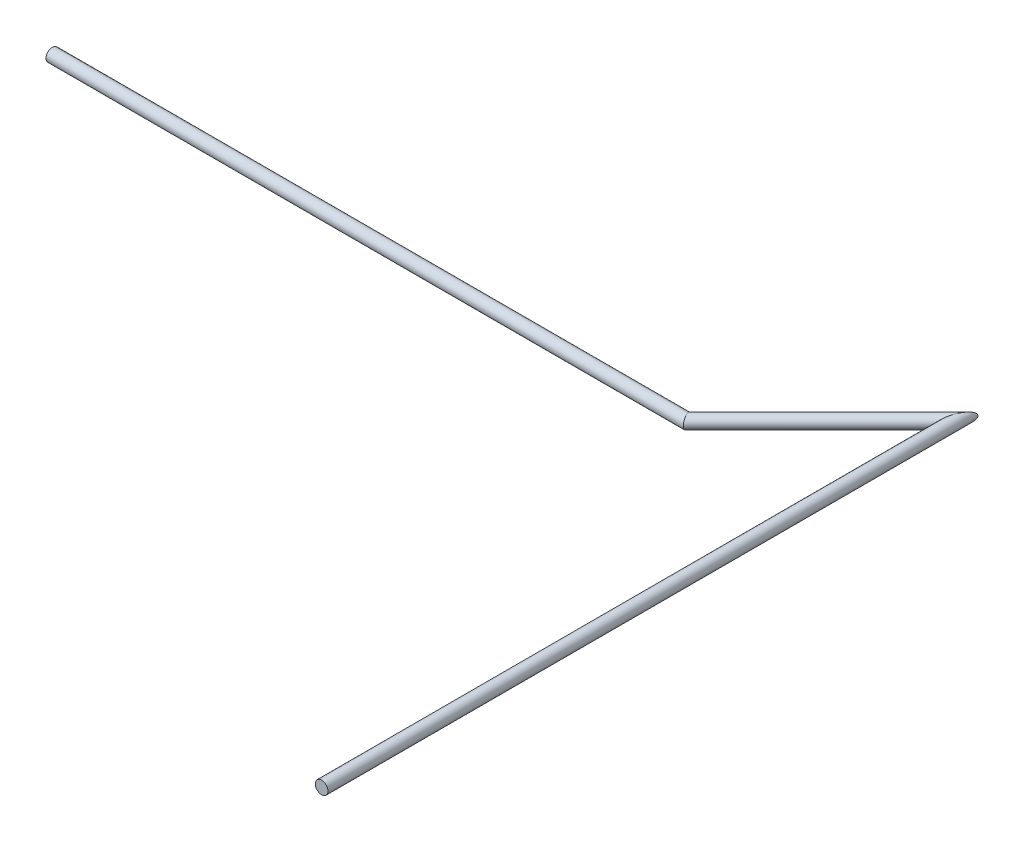
ISO-10303-21;
HEADER;
FILE_DESCRIPTION(('STEP AP214'),'2;1');
FILE_NAME('part.step','',(''),(''),'','','');
FILE_SCHEMA(('AUTOMOTIVE_DESIGN { 1 0 10303 214 1 1 1 1 }'));
ENDSEC;
DATA;
#1=APPLICATION_CONTEXT('core data for automotive mechanical design processes');
#2=APPLICATION_PROTOCOL_DEFINITION('international standard','automotive_design',2000,#1);
#3=PRODUCT_CONTEXT('',#1,'mechanical');
#4=PRODUCT('Part','Part','',(#3));
#5=PRODUCT_RELATED_PRODUCT_CATEGORY('part','',(#4));
#6=PRODUCT_DEFINITION_FORMATION('','',#4);
#7=PRODUCT_DEFINITION_CONTEXT('part definition',#1,'design');
#8=PRODUCT_DEFINITION('design','',#6,#7);
#9=PRODUCT_DEFINITION_SHAPE('','',#8);
#10=(LENGTH_UNIT() NAMED_UNIT(*) SI_UNIT(.MILLI.,.METRE.));
#11=(NAMED_UNIT(*) PLANE_ANGLE_UNIT() SI_UNIT($,.RADIAN.));
#12=(NAMED_UNIT(*) SI_UNIT($,.STERADIAN.) SOLID_ANGLE_UNIT());
#13=UNCERTAINTY_MEASURE_WITH_UNIT(LENGTH_MEASURE(1.E-05),#10,'distance_accuracy_value','');
#14=(GEOMETRIC_REPRESENTATION_CONTEXT(3) GLOBAL_UNCERTAINTY_ASSIGNED_CONTEXT((#13)) GLOBAL_UNIT_ASSIGNED_CONTEXT((#10,
#11,#12)) REPRESENTATION_CONTEXT('',''));
#15=CARTESIAN_POINT('',(0.,0.,0.));
#16=DIRECTION('',(0.,0.,1.));
#17=DIRECTION('',(1.,0.,0.));
#18=AXIS2_PLACEMENT_3D('',#15,#16,#17);
#19=CARTESIAN_POINT('',(-106.066017177982,0.,106.066017177982));
#20=DIRECTION('',(-1.,0.,0.));
#21=DIRECTION('',(0.,-1.,0.));
#22=AXIS2_PLACEMENT_3D('',#19,#20,#21);
#23=CYLINDRICAL_SURFACE('',#22,5.);
#24=CARTESIAN_POINT('',(-606.066017177982,0.,106.066017177982));
#25=DIRECTION('',(1.,0.,0.));
#26=DIRECTION('',(0.,0.,-1.));
#27=AXIS2_PLACEMENT_3D('',#24,#25,#26);
#28=CIRCLE('',#27,5.);
#29=CARTESIAN_POINT('',(-606.066017177982,0.,101.066017177982));
#30=VERTEX_POINT('',#29);
#31=EDGE_CURVE('E56',#30,#30,#28,.T.);
#32=ORIENTED_EDGE('',*,*,#31,.T.);
#33=EDGE_LOOP('',(#32));
#34=FACE_BOUND('',#33,.T.);
#35=CARTESIAN_POINT('',(-106.066017177982,0.,106.066017177982));
#36=DIRECTION('',(0.923879532511287,0.,-0.38268343236509));
#37=DIRECTION('',(-0.38268343236509,0.,-0.923879532511287));
#38=AXIS2_PLACEMENT_3D('',#35,#36,#37);
#39=ELLIPSE('',#38,5.41196100146197,5.);
#40=CARTESIAN_POINT('',(-108.137084989847,0.,101.066017177982));
#41=VERTEX_POINT('',#40);
#42=EDGE_CURVE('E12',#41,#41,#39,.T.);
#43=ORIENTED_EDGE('',*,*,#42,.F.);
#44=EDGE_LOOP('',(#43));
#45=FACE_BOUND('',#44,.T.);
#46=ADVANCED_FACE('F49',(#34,#45),#23,.T.);
#47=CARTESIAN_POINT('',(-606.066017177982,0.,106.066017177982));
#48=DIRECTION('',(1.,0.,0.));
#49=DIRECTION('',(0.,0.,-1.));
#50=AXIS2_PLACEMENT_3D('',#47,#48,#49);
#51=PLANE('',#50);
#52=ORIENTED_EDGE('',*,*,#31,.F.);
#53=EDGE_LOOP('',(#52));
#54=FACE_BOUND('',#53,.T.);
#55=ADVANCED_FACE('F64',(#54),#51,.F.);
#56=CARTESIAN_POINT('',(-106.066017177982,0.,106.066017177982));
#57=DIRECTION('',(0.923879532511287,0.,-0.38268343236509));
#58=DIRECTION('',(-0.38268343236509,0.,-0.923879532511287));
#59=AXIS2_PLACEMENT_3D('',#56,#57,#58);
#60=PLANE('',#59);
#61=ORIENTED_EDGE('',*,*,#42,.T.);
#62=EDGE_LOOP('',(#61));
#63=FACE_BOUND('',#62,.T.);
#64=ADVANCED_FACE('F51',(#63),#60,.T.);
#65=CLOSED_SHELL('',(#46,#55,#64));
#66=MANIFOLD_SOLID_BREP('B2',#65);
#67=CARTESIAN_POINT('',(0.,0.,0.));
#68=DIRECTION('',(-0.707106781186546,0.,0.707106781186549));
#69=DIRECTION('',(0.707106781186549,0.,0.707106781186546));
#70=AXIS2_PLACEMENT_3D('',#67,#68,#69);
#71=CYLINDRICAL_SURFACE('',#70,5.);
#72=CARTESIAN_POINT('',(0.,0.,0.));
#73=DIRECTION('',(0.923879532511287,0.,0.382683432365089));
#74=DIRECTION('',(-0.382683432365089,0.,0.923879532511287));
#75=AXIS2_PLACEMENT_3D('',#72,#73,#74);
#76=ELLIPSE('',#75,13.0656296487638,5.);
#77=CARTESIAN_POINT('',(-4.99999999999997,0.,12.0710678118654));
#78=VERTEX_POINT('',#77);
#79=EDGE_CURVE('E124',#78,#78,#76,.T.);
#80=ORIENTED_EDGE('',*,*,#79,.F.);
#81=EDGE_LOOP('',(#80));
#82=FACE_BOUND('',#81,.T.);
#83=CARTESIAN_POINT('',(-106.066017177982,0.,106.066017177982));
#84=DIRECTION('',(-0.923879532511287,0.,0.38268343236509));
#85=DIRECTION('',(0.38268343236509,0.,0.923879532511287));
#86=AXIS2_PLACEMENT_3D('',#83,#84,#85);
#87=ELLIPSE('',#86,5.41196100146197,5.);
#88=CARTESIAN_POINT('',(-103.994949366116,0.,111.066017177982));
#89=VERTEX_POINT('',#88);
#90=EDGE_CURVE('E48',#89,#89,#87,.T.);
#91=ORIENTED_EDGE('',*,*,#90,.F.);
#92=EDGE_LOOP('',(#91));
#93=FACE_BOUND('',#92,.T.);
#94=ADVANCED_FACE('F117',(#82,#93),#71,.T.);
#95=CARTESIAN_POINT('',(0.,0.,0.));
#96=DIRECTION('',(0.923879532511287,0.,0.382683432365089));
#97=DIRECTION('',(0.382683432365089,0.,-0.923879532511287));
#98=AXIS2_PLACEMENT_3D('',#95,#96,#97);
#99=PLANE('',#98);
#100=ORIENTED_EDGE('',*,*,#79,.T.);
#101=EDGE_LOOP('',(#100));
#102=FACE_BOUND('',#101,.T.);
#103=ADVANCED_FACE('F130',(#102),#99,.T.);
#104=CARTESIAN_POINT('',(-106.066017177982,0.,106.066017177982));
#105=DIRECTION('',(-0.923879532511287,0.,0.38268343236509));
#106=DIRECTION('',(0.38268343236509,0.,0.923879532511287));
#107=AXIS2_PLACEMENT_3D('',#104,#105,#106);
#108=PLANE('',#107);
#109=ORIENTED_EDGE('',*,*,#90,.T.);
#110=EDGE_LOOP('',(#109));
#111=FACE_BOUND('',#110,.T.);
#112=ADVANCED_FACE('F119',(#111),#108,.T.);
#113=CLOSED_SHELL('',(#94,#103,#112));
#114=MANIFOLD_SOLID_BREP('B7',#113);
#115=CARTESIAN_POINT('',(0.,0.,500.));
#116=DIRECTION('',(0.,0.,-1.));
#117=DIRECTION('',(-1.,0.,0.));
#118=AXIS2_PLACEMENT_3D('',#115,#116,#117);
#119=CYLINDRICAL_SURFACE('',#118,5.);
#120=CARTESIAN_POINT('',(0.,0.,500.));
#121=DIRECTION('',(0.,0.,1.));
#122=DIRECTION('',(1.,0.,0.));
#123=AXIS2_PLACEMENT_3D('',#120,#121,#122);
#124=CIRCLE('',#123,5.);
#125=CARTESIAN_POINT('',(5.,0.,500.));
#126=VERTEX_POINT('',#125);
#127=EDGE_CURVE('E187',#126,#126,#124,.T.);
#128=ORIENTED_EDGE('',*,*,#127,.F.);
#129=EDGE_LOOP('',(#128));
#130=FACE_BOUND('',#129,.T.);
#131=CARTESIAN_POINT('',(0.,0.,0.));
#132=DIRECTION('',(-0.923879532511287,0.,-0.382683432365089));
#133=DIRECTION('',(0.382683432365089,0.,-0.923879532511287));
#134=AXIS2_PLACEMENT_3D('',#131,#132,#133);
#135=ELLIPSE('',#134,13.0656296487638,5.);
#136=CARTESIAN_POINT('',(5.,0.,-12.0710678118655));
#137=VERTEX_POINT('',#136);
#138=EDGE_CURVE('E116',#137,#137,#135,.T.);
#139=ORIENTED_EDGE('',*,*,#138,.F.);
#140=EDGE_LOOP('',(#139));
#141=FACE_BOUND('',#140,.T.);
#142=ADVANCED_FACE('F180',(#130,#141),#119,.T.);
#143=CARTESIAN_POINT('',(0.,0.,500.));
#144=DIRECTION('',(0.,0.,1.));
#145=DIRECTION('',(1.,0.,0.));
#146=AXIS2_PLACEMENT_3D('',#143,#144,#145);
#147=PLANE('',#146);
#148=ORIENTED_EDGE('',*,*,#127,.T.);
#149=EDGE_LOOP('',(#148));
#150=FACE_BOUND('',#149,.T.);
#151=ADVANCED_FACE('F193',(#150),#147,.T.);
#152=CARTESIAN_POINT('',(0.,0.,0.));
#153=DIRECTION('',(-0.923879532511287,0.,-0.382683432365089));
#154=DIRECTION('',(-0.382683432365089,0.,0.923879532511287));
#155=AXIS2_PLACEMENT_3D('',#152,#153,#154);
#156=PLANE('',#155);
#157=ORIENTED_EDGE('',*,*,#138,.T.);
#158=EDGE_LOOP('',(#157));
#159=FACE_BOUND('',#158,.T.);
#160=ADVANCED_FACE('F182',(#159),#156,.T.);
#161=CLOSED_SHELL('',(#142,#151,#160));
#162=MANIFOLD_SOLID_BREP('B43',#161);
#163=ADVANCED_BREP_SHAPE_REPRESENTATION('',(#18,#66,#114,#162),#14);
#164=SHAPE_DEFINITION_REPRESENTATION(#9,#163);
ENDSEC;
END-ISO-10303-21;
